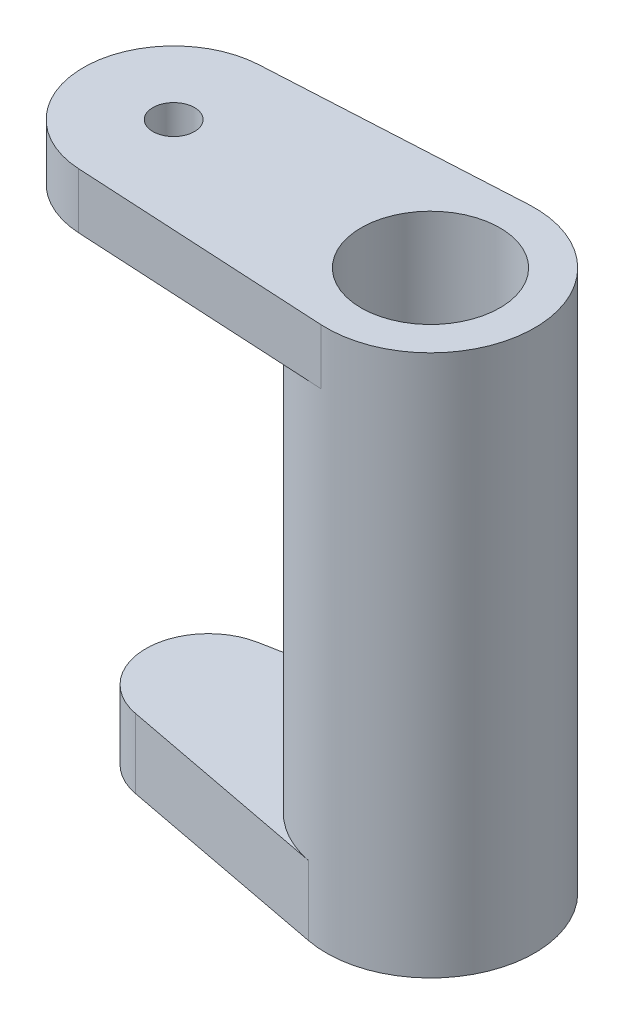
ISO-10303-21;
HEADER;
FILE_DESCRIPTION(('STEP AP214'),'2;1');
FILE_NAME('part.step','',(''),(''),'','','');
FILE_SCHEMA(('AUTOMOTIVE_DESIGN { 1 0 10303 214 1 1 1 1 }'));
ENDSEC;
DATA;
#1=APPLICATION_CONTEXT('core data for automotive mechanical design processes');
#2=APPLICATION_PROTOCOL_DEFINITION('international standard','automotive_design',2000,#1);
#3=PRODUCT_CONTEXT('',#1,'mechanical');
#4=PRODUCT('Part','Part','',(#3));
#5=PRODUCT_RELATED_PRODUCT_CATEGORY('part','',(#4));
#6=PRODUCT_DEFINITION_FORMATION('','',#4);
#7=PRODUCT_DEFINITION_CONTEXT('part definition',#1,'design');
#8=PRODUCT_DEFINITION('design','',#6,#7);
#9=PRODUCT_DEFINITION_SHAPE('','',#8);
#10=(LENGTH_UNIT() NAMED_UNIT(*) SI_UNIT(.MILLI.,.METRE.));
#11=(NAMED_UNIT(*) PLANE_ANGLE_UNIT() SI_UNIT($,.RADIAN.));
#12=(NAMED_UNIT(*) SI_UNIT($,.STERADIAN.) SOLID_ANGLE_UNIT());
#13=UNCERTAINTY_MEASURE_WITH_UNIT(LENGTH_MEASURE(1.E-05),#10,'distance_accuracy_value','');
#14=(GEOMETRIC_REPRESENTATION_CONTEXT(3) GLOBAL_UNCERTAINTY_ASSIGNED_CONTEXT((#13)) GLOBAL_UNIT_ASSIGNED_CONTEXT((#10,
#11,#12)) REPRESENTATION_CONTEXT('',''));
#15=CARTESIAN_POINT('',(0.,0.,0.));
#16=DIRECTION('',(0.,0.,1.));
#17=DIRECTION('',(1.,0.,0.));
#18=AXIS2_PLACEMENT_3D('',#15,#16,#17);
#19=CARTESIAN_POINT('',(-15.1843019154314,30.,1.03253253024933));
#20=DIRECTION('',(0.,-1.,0.));
#21=DIRECTION('',(0.,0.,-1.));
#22=AXIS2_PLACEMENT_3D('',#19,#20,#21);
#23=CYLINDRICAL_SURFACE('',#22,7.5);
#24=CARTESIAN_POINT('',(-15.1843019154314,30.,1.03253253024933));
#25=DIRECTION('',(0.,1.,0.));
#26=DIRECTION('',(0.,0.,1.));
#27=AXIS2_PLACEMENT_3D('',#24,#25,#26);
#28=CIRCLE('',#27,7.5);
#29=CARTESIAN_POINT('',(-15.5897073208368,30.,-6.45650255160654));
#30=VERTEX_POINT('',#29);
#31=CARTESIAN_POINT('',(-15.5897073208368,30.,8.52156761210521));
#32=VERTEX_POINT('',#31);
#33=EDGE_CURVE('E11',#30,#32,#28,.T.);
#34=ORIENTED_EDGE('',*,*,#33,.F.);
#35=DIRECTION('',(0.,-1.,0.));
#36=VECTOR('',#35,1.);
#37=CARTESIAN_POINT('',(-15.5897073208368,34.,-6.45650255160654));
#38=LINE('',#37,#36);
#39=CARTESIAN_POINT('',(-15.5897073208368,34.,-6.45650255160654));
#40=VERTEX_POINT('',#39);
#41=EDGE_CURVE('E148',#40,#30,#38,.T.);
#42=ORIENTED_EDGE('',*,*,#41,.F.);
#43=CARTESIAN_POINT('',(-15.1843019154314,34.,1.03253253024933));
#44=DIRECTION('',(0.,1.,0.));
#45=DIRECTION('',(0.,0.,1.));
#46=AXIS2_PLACEMENT_3D('',#43,#44,#45);
#47=CIRCLE('',#46,7.5);
#48=CARTESIAN_POINT('',(-15.5897073208368,34.,8.52156761210521));
#49=VERTEX_POINT('',#48);
#50=EDGE_CURVE('E131',#49,#40,#47,.T.);
#51=ORIENTED_EDGE('',*,*,#50,.F.);
#52=DIRECTION('',(0.,-1.,0.));
#53=VECTOR('',#52,1.);
#54=CARTESIAN_POINT('',(-15.5897073208368,34.,8.52156761210521));
#55=LINE('',#54,#53);
#56=EDGE_CURVE('E141',#49,#32,#55,.T.);
#57=ORIENTED_EDGE('',*,*,#56,.T.);
#58=EDGE_LOOP('',(#34,#42,#51,#57));
#59=FACE_BOUND('',#58,.T.);
#60=CARTESIAN_POINT('',(-15.1843019154314,0.,1.03253253024933));
#61=DIRECTION('',(0.,1.,0.));
#62=DIRECTION('',(0.,0.,1.));
#63=AXIS2_PLACEMENT_3D('',#60,#61,#62);
#64=CIRCLE('',#63,7.5);
#65=CARTESIAN_POINT('',(-16.5905519154314,0.,-6.33445199107959));
#66=VERTEX_POINT('',#65);
#67=CARTESIAN_POINT('',(-16.5905519154314,0.,8.39951705157826));
#68=VERTEX_POINT('',#67);
#69=EDGE_CURVE('E41',#66,#68,#64,.T.);
#70=ORIENTED_EDGE('',*,*,#69,.T.);
#71=DIRECTION('',(0.,1.,0.));
#72=VECTOR('',#71,1.);
#73=CARTESIAN_POINT('',(-16.5905519154314,-5.,8.39951705157826));
#74=LINE('',#73,#72);
#75=CARTESIAN_POINT('',(-16.5905519154314,-5.,8.39951705157826));
#76=VERTEX_POINT('',#75);
#77=EDGE_CURVE('E125',#76,#68,#74,.T.);
#78=ORIENTED_EDGE('',*,*,#77,.F.);
#79=CARTESIAN_POINT('',(-15.1843019154314,-5.,1.03253253024933));
#80=DIRECTION('',(0.,-1.,0.));
#81=DIRECTION('',(0.,0.,-1.));
#82=AXIS2_PLACEMENT_3D('',#79,#80,#81);
#83=CIRCLE('',#82,7.5);
#84=CARTESIAN_POINT('',(-16.5905519154314,-5.,-6.33445199107959));
#85=VERTEX_POINT('',#84);
#86=EDGE_CURVE('E106',#85,#76,#83,.T.);
#87=ORIENTED_EDGE('',*,*,#86,.F.);
#88=DIRECTION('',(0.,1.,0.));
#89=VECTOR('',#88,1.);
#90=CARTESIAN_POINT('',(-16.5905519154314,-5.,-6.33445199107959));
#91=LINE('',#90,#89);
#92=EDGE_CURVE('E49',#85,#66,#91,.T.);
#93=ORIENTED_EDGE('',*,*,#92,.T.);
#94=EDGE_LOOP('',(#70,#78,#87,#93));
#95=FACE_BOUND('',#94,.T.);
#96=ADVANCED_FACE('F33',(#59,#95),#23,.T.);
#97=CARTESIAN_POINT('',(-15.1843019154314,30.,1.03253253024933));
#98=DIRECTION('',(0.,1.,0.));
#99=DIRECTION('',(0.,0.,1.));
#100=AXIS2_PLACEMENT_3D('',#97,#98,#99);
#101=PLANE('',#100);
#102=CARTESIAN_POINT('',(-33.6843019154314,30.,1.03253253024933));
#103=DIRECTION('',(0.,1.,0.));
#104=DIRECTION('',(0.,0.,1.));
#105=AXIS2_PLACEMENT_3D('',#102,#103,#104);
#106=CIRCLE('',#105,1.5);
#107=CARTESIAN_POINT('',(-33.6843019154314,30.,2.53253253024934));
#108=VERTEX_POINT('',#107);
#109=EDGE_CURVE('E185',#108,#108,#106,.T.);
#110=ORIENTED_EDGE('',*,*,#109,.T.);
#111=EDGE_LOOP('',(#110));
#112=FACE_BOUND('',#111,.T.);
#113=DIRECTION('',(-0.998538010914117,0.,0.054054054054054));
#114=VECTOR('',#113,1.);
#115=CARTESIAN_POINT('',(-15.5897073208368,30.,-6.45650255160654));
#116=LINE('',#115,#114);
#117=CARTESIAN_POINT('',(-34.0356532667827,30.,-5.45796454069243));
#118=VERTEX_POINT('',#117);
#119=EDGE_CURVE('E121',#30,#118,#116,.T.);
#120=ORIENTED_EDGE('',*,*,#119,.F.);
#121=ORIENTED_EDGE('',*,*,#33,.T.);
#122=DIRECTION('',(0.998538010914117,0.,0.054054054054054));
#123=VECTOR('',#122,1.);
#124=CARTESIAN_POINT('',(-15.5897073208368,30.,8.52156761210521));
#125=LINE('',#124,#123);
#126=CARTESIAN_POINT('',(-34.0356532667827,30.,7.52302960119109));
#127=VERTEX_POINT('',#126);
#128=EDGE_CURVE('E135',#127,#32,#125,.T.);
#129=ORIENTED_EDGE('',*,*,#128,.F.);
#130=CARTESIAN_POINT('',(-33.6843019154314,30.,1.03253253024933));
#131=DIRECTION('',(0.,1.,0.));
#132=DIRECTION('',(0.,0.,1.));
#133=AXIS2_PLACEMENT_3D('',#130,#131,#132);
#134=CIRCLE('',#133,6.5);
#135=EDGE_CURVE('E123',#118,#127,#134,.T.);
#136=ORIENTED_EDGE('',*,*,#135,.F.);
#137=EDGE_LOOP('',(#120,#121,#129,#136));
#138=FACE_BOUND('',#137,.T.);
#139=ADVANCED_FACE('F214',(#112,#138),#101,.F.);
#140=CARTESIAN_POINT('',(-15.5897073208368,34.,-6.45650255160654));
#141=DIRECTION('',(0.054054054054054,0.,0.998538010914117));
#142=DIRECTION('',(0.998538010914117,0.,-0.054054054054054));
#143=AXIS2_PLACEMENT_3D('',#140,#141,#142);
#144=PLANE('',#143);
#145=ORIENTED_EDGE('',*,*,#119,.T.);
#146=DIRECTION('',(0.,-1.,0.));
#147=VECTOR('',#146,1.);
#148=CARTESIAN_POINT('',(-34.0356532667827,34.,-5.45796454069243));
#149=LINE('',#148,#147);
#150=CARTESIAN_POINT('',(-34.0356532667827,34.,-5.45796454069243));
#151=VERTEX_POINT('',#150);
#152=EDGE_CURVE('E146',#151,#118,#149,.T.);
#153=ORIENTED_EDGE('',*,*,#152,.F.);
#154=DIRECTION('',(-0.998538010914117,0.,0.054054054054054));
#155=VECTOR('',#154,1.);
#156=CARTESIAN_POINT('',(-15.5897073208368,34.,-6.45650255160654));
#157=LINE('',#156,#155);
#158=EDGE_CURVE('E134',#40,#151,#157,.T.);
#159=ORIENTED_EDGE('',*,*,#158,.F.);
#160=ORIENTED_EDGE('',*,*,#41,.T.);
#161=EDGE_LOOP('',(#145,#153,#159,#160));
#162=FACE_BOUND('',#161,.T.);
#163=ADVANCED_FACE('F219',(#162),#144,.F.);
#164=CARTESIAN_POINT('',(-33.6843019154314,34.,1.03253253024933));
#165=DIRECTION('',(0.,-1.,0.));
#166=DIRECTION('',(0.,0.,-1.));
#167=AXIS2_PLACEMENT_3D('',#164,#165,#166);
#168=CYLINDRICAL_SURFACE('',#167,6.5);
#169=ORIENTED_EDGE('',*,*,#135,.T.);
#170=DIRECTION('',(0.,-1.,0.));
#171=VECTOR('',#170,1.);
#172=CARTESIAN_POINT('',(-34.0356532667827,34.,7.52302960119109));
#173=LINE('',#172,#171);
#174=CARTESIAN_POINT('',(-34.0356532667827,34.,7.52302960119109));
#175=VERTEX_POINT('',#174);
#176=EDGE_CURVE('E143',#175,#127,#173,.T.);
#177=ORIENTED_EDGE('',*,*,#176,.F.);
#178=CARTESIAN_POINT('',(-33.6843019154314,34.,1.03253253024933));
#179=DIRECTION('',(0.,1.,0.));
#180=DIRECTION('',(0.,0.,1.));
#181=AXIS2_PLACEMENT_3D('',#178,#179,#180);
#182=CIRCLE('',#181,6.5);
#183=EDGE_CURVE('E137',#151,#175,#182,.T.);
#184=ORIENTED_EDGE('',*,*,#183,.F.);
#185=ORIENTED_EDGE('',*,*,#152,.T.);
#186=EDGE_LOOP('',(#169,#177,#184,#185));
#187=FACE_BOUND('',#186,.T.);
#188=ADVANCED_FACE('F236',(#187),#168,.T.);
#189=CARTESIAN_POINT('',(-15.5897073208368,34.,8.52156761210521));
#190=DIRECTION('',(0.054054054054054,0.,-0.998538010914117));
#191=DIRECTION('',(-0.998538010914117,0.,-0.054054054054054));
#192=AXIS2_PLACEMENT_3D('',#189,#190,#191);
#193=PLANE('',#192);
#194=ORIENTED_EDGE('',*,*,#128,.T.);
#195=ORIENTED_EDGE('',*,*,#56,.F.);
#196=DIRECTION('',(0.998538010914117,0.,0.054054054054054));
#197=VECTOR('',#196,1.);
#198=CARTESIAN_POINT('',(-15.5897073208368,34.,8.52156761210521));
#199=LINE('',#198,#197);
#200=EDGE_CURVE('E139',#175,#49,#199,.T.);
#201=ORIENTED_EDGE('',*,*,#200,.F.);
#202=ORIENTED_EDGE('',*,*,#176,.T.);
#203=EDGE_LOOP('',(#194,#195,#201,#202));
#204=FACE_BOUND('',#203,.T.);
#205=ADVANCED_FACE('F234',(#204),#193,.F.);
#206=CARTESIAN_POINT('',(-15.1843019154314,34.,1.03253253024933));
#207=DIRECTION('',(0.,1.,0.));
#208=DIRECTION('',(0.,0.,1.));
#209=AXIS2_PLACEMENT_3D('',#206,#207,#208);
#210=PLANE('',#209);
#211=CARTESIAN_POINT('',(-15.1843019154314,34.,1.03253253024933));
#212=DIRECTION('',(0.,1.,0.));
#213=DIRECTION('',(0.,0.,1.));
#214=AXIS2_PLACEMENT_3D('',#211,#212,#213);
#215=CIRCLE('',#214,5.);
#216=CARTESIAN_POINT('',(-15.1843019154314,34.,6.03253253024933));
#217=VERTEX_POINT('',#216);
#218=EDGE_CURVE('E194',#217,#217,#215,.T.);
#219=ORIENTED_EDGE('',*,*,#218,.F.);
#220=EDGE_LOOP('',(#219));
#221=FACE_BOUND('',#220,.T.);
#222=CARTESIAN_POINT('',(-33.6843019154314,34.,1.03253253024933));
#223=DIRECTION('',(0.,1.,0.));
#224=DIRECTION('',(0.,0.,1.));
#225=AXIS2_PLACEMENT_3D('',#222,#223,#224);
#226=CIRCLE('',#225,1.5);
#227=CARTESIAN_POINT('',(-33.6843019154314,34.,2.53253253024934));
#228=VERTEX_POINT('',#227);
#229=EDGE_CURVE('E187',#228,#228,#226,.T.);
#230=ORIENTED_EDGE('',*,*,#229,.F.);
#231=EDGE_LOOP('',(#230));
#232=FACE_BOUND('',#231,.T.);
#233=ORIENTED_EDGE('',*,*,#50,.T.);
#234=ORIENTED_EDGE('',*,*,#158,.T.);
#235=ORIENTED_EDGE('',*,*,#183,.T.);
#236=ORIENTED_EDGE('',*,*,#200,.T.);
#237=EDGE_LOOP('',(#233,#234,#235,#236));
#238=FACE_BOUND('',#237,.T.);
#239=ADVANCED_FACE('F230',(#221,#232,#238),#210,.T.);
#240=CARTESIAN_POINT('',(-31.1843019154313,-5.,1.03253253024933));
#241=DIRECTION('',(0.,1.,0.));
#242=DIRECTION('',(0.,0.,1.));
#243=AXIS2_PLACEMENT_3D('',#240,#241,#242);
#244=CYLINDRICAL_SURFACE('',#243,4.5);
#245=CARTESIAN_POINT('',(-31.1843019154313,0.,1.03253253024933));
#246=DIRECTION('',(0.,-1.,0.));
#247=DIRECTION('',(0.,0.,-1.));
#248=AXIS2_PLACEMENT_3D('',#245,#246,#247);
#249=CIRCLE('',#248,4.5);
#250=CARTESIAN_POINT('',(-32.0280519154313,0.,5.45272324304669));
#251=VERTEX_POINT('',#250);
#252=CARTESIAN_POINT('',(-32.0280519154313,0.,-3.38765818254803));
#253=VERTEX_POINT('',#252);
#254=EDGE_CURVE('E120',#251,#253,#249,.T.);
#255=ORIENTED_EDGE('',*,*,#254,.T.);
#256=DIRECTION('',(0.,1.,0.));
#257=VECTOR('',#256,1.);
#258=CARTESIAN_POINT('',(-32.0280519154313,-5.,-3.38765818254803));
#259=LINE('',#258,#257);
#260=CARTESIAN_POINT('',(-32.0280519154313,-5.,-3.38765818254803));
#261=VERTEX_POINT('',#260);
#262=EDGE_CURVE('E103',#261,#253,#259,.T.);
#263=ORIENTED_EDGE('',*,*,#262,.F.);
#264=CARTESIAN_POINT('',(-31.1843019154313,-5.,1.03253253024933));
#265=DIRECTION('',(0.,-1.,0.));
#266=DIRECTION('',(0.,0.,-1.));
#267=AXIS2_PLACEMENT_3D('',#264,#265,#266);
#268=CIRCLE('',#267,4.5);
#269=CARTESIAN_POINT('',(-32.0280519154313,-5.,5.45272324304669));
#270=VERTEX_POINT('',#269);
#271=EDGE_CURVE('E107',#270,#261,#268,.T.);
#272=ORIENTED_EDGE('',*,*,#271,.F.);
#273=DIRECTION('',(0.,1.,0.));
#274=VECTOR('',#273,1.);
#275=CARTESIAN_POINT('',(-32.0280519154313,-5.,5.45272324304669));
#276=LINE('',#275,#274);
#277=EDGE_CURVE('E129',#270,#251,#276,.T.);
#278=ORIENTED_EDGE('',*,*,#277,.T.);
#279=EDGE_LOOP('',(#255,#263,#272,#278));
#280=FACE_BOUND('',#279,.T.);
#281=ADVANCED_FACE('F118',(#280),#244,.T.);
#282=CARTESIAN_POINT('',(-32.0280519154313,-5.,-3.38765818254803));
#283=DIRECTION('',(0.1875,0.,0.982264602843857));
#284=DIRECTION('',(0.982264602843857,0.,-0.1875));
#285=AXIS2_PLACEMENT_3D('',#282,#283,#284);
#286=PLANE('',#285);
#287=DIRECTION('',(0.982264602843857,0.,-0.1875));
#288=VECTOR('',#287,1.);
#289=CARTESIAN_POINT('',(-32.0280519154313,0.,-3.38765818254803));
#290=LINE('',#289,#288);
#291=EDGE_CURVE('E170',#253,#66,#290,.T.);
#292=ORIENTED_EDGE('',*,*,#291,.T.);
#293=ORIENTED_EDGE('',*,*,#92,.F.);
#294=DIRECTION('',(0.982264602843857,0.,-0.1875));
#295=VECTOR('',#294,1.);
#296=CARTESIAN_POINT('',(-32.0280519154313,-5.,-3.38765818254803));
#297=LINE('',#296,#295);
#298=EDGE_CURVE('E99',#261,#85,#297,.T.);
#299=ORIENTED_EDGE('',*,*,#298,.F.);
#300=ORIENTED_EDGE('',*,*,#262,.T.);
#301=EDGE_LOOP('',(#292,#293,#299,#300));
#302=FACE_BOUND('',#301,.T.);
#303=ADVANCED_FACE('F101',(#302),#286,.F.);
#304=CARTESIAN_POINT('',(-32.0280519154313,-5.,5.45272324304669));
#305=DIRECTION('',(0.1875,0.,-0.982264602843857));
#306=DIRECTION('',(-0.982264602843857,0.,-0.1875));
#307=AXIS2_PLACEMENT_3D('',#304,#305,#306);
#308=PLANE('',#307);
#309=DIRECTION('',(-0.982264602843857,0.,-0.1875));
#310=VECTOR('',#309,1.);
#311=CARTESIAN_POINT('',(-32.0280519154313,0.,5.45272324304669));
#312=LINE('',#311,#310);
#313=EDGE_CURVE('E116',#68,#251,#312,.T.);
#314=ORIENTED_EDGE('',*,*,#313,.T.);
#315=ORIENTED_EDGE('',*,*,#277,.F.);
#316=DIRECTION('',(-0.982264602843857,0.,-0.1875));
#317=VECTOR('',#316,1.);
#318=CARTESIAN_POINT('',(-32.0280519154313,-5.,5.45272324304669));
#319=LINE('',#318,#317);
#320=EDGE_CURVE('E112',#76,#270,#319,.T.);
#321=ORIENTED_EDGE('',*,*,#320,.F.);
#322=ORIENTED_EDGE('',*,*,#77,.T.);
#323=EDGE_LOOP('',(#314,#315,#321,#322));
#324=FACE_BOUND('',#323,.T.);
#325=ADVANCED_FACE('F180',(#324),#308,.F.);
#326=CARTESIAN_POINT('',(-31.1843019154313,-5.,1.03253253024933));
#327=DIRECTION('',(0.,-1.,0.));
#328=DIRECTION('',(0.,0.,-1.));
#329=AXIS2_PLACEMENT_3D('',#326,#327,#328);
#330=PLANE('',#329);
#331=CARTESIAN_POINT('',(-15.1843019154314,-5.,1.03253253024933));
#332=DIRECTION('',(0.,-1.,0.));
#333=DIRECTION('',(0.,0.,-1.));
#334=AXIS2_PLACEMENT_3D('',#331,#332,#333);
#335=CIRCLE('',#334,5.);
#336=CARTESIAN_POINT('',(-15.1843019154314,-5.,-3.96746746975067));
#337=VERTEX_POINT('',#336);
#338=EDGE_CURVE('E36',#337,#337,#335,.T.);
#339=ORIENTED_EDGE('',*,*,#338,.F.);
#340=EDGE_LOOP('',(#339));
#341=FACE_BOUND('',#340,.T.);
#342=ORIENTED_EDGE('',*,*,#271,.T.);
#343=ORIENTED_EDGE('',*,*,#298,.T.);
#344=ORIENTED_EDGE('',*,*,#86,.T.);
#345=ORIENTED_EDGE('',*,*,#320,.T.);
#346=EDGE_LOOP('',(#342,#343,#344,#345));
#347=FACE_BOUND('',#346,.T.);
#348=ADVANCED_FACE('F110',(#341,#347),#330,.T.);
#349=CARTESIAN_POINT('',(-31.1843019154313,0.,1.03253253024933));
#350=DIRECTION('',(0.,-1.,0.));
#351=DIRECTION('',(0.,0.,-1.));
#352=AXIS2_PLACEMENT_3D('',#349,#350,#351);
#353=PLANE('',#352);
#354=ORIENTED_EDGE('',*,*,#69,.F.);
#355=ORIENTED_EDGE('',*,*,#291,.F.);
#356=ORIENTED_EDGE('',*,*,#254,.F.);
#357=ORIENTED_EDGE('',*,*,#313,.F.);
#358=EDGE_LOOP('',(#354,#355,#356,#357));
#359=FACE_BOUND('',#358,.T.);
#360=ADVANCED_FACE('F184',(#359),#353,.F.);
#361=CARTESIAN_POINT('',(-33.6843019154314,29.,1.03253253024933));
#362=DIRECTION('',(0.,1.,0.));
#363=DIRECTION('',(0.,0.,1.));
#364=AXIS2_PLACEMENT_3D('',#361,#362,#363);
#365=CYLINDRICAL_SURFACE('',#364,1.5);
#366=ORIENTED_EDGE('',*,*,#229,.T.);
#367=EDGE_LOOP('',(#366));
#368=FACE_BOUND('',#367,.T.);
#369=ORIENTED_EDGE('',*,*,#109,.F.);
#370=EDGE_LOOP('',(#369));
#371=FACE_BOUND('',#370,.T.);
#372=ADVANCED_FACE('F209',(#368,#371),#365,.F.);
#373=CARTESIAN_POINT('',(-15.1843019154314,-5.000025,1.03253253024933));
#374=DIRECTION('',(0.,1.,0.));
#375=DIRECTION('',(0.,0.,1.));
#376=AXIS2_PLACEMENT_3D('',#373,#374,#375);
#377=CYLINDRICAL_SURFACE('',#376,5.);
#378=ORIENTED_EDGE('',*,*,#338,.T.);
#379=EDGE_LOOP('',(#378));
#380=FACE_BOUND('',#379,.T.);
#381=ORIENTED_EDGE('',*,*,#218,.T.);
#382=EDGE_LOOP('',(#381));
#383=FACE_BOUND('',#382,.T.);
#384=ADVANCED_FACE('F201',(#380,#383),#377,.F.);
#385=CLOSED_SHELL('',(#96,#139,#163,#188,#205,#239,#281,#303,#325,#348,#360,#372,#384));
#386=MANIFOLD_SOLID_BREP('B2',#385);
#387=ADVANCED_BREP_SHAPE_REPRESENTATION('',(#18,#386),#14);
#388=SHAPE_DEFINITION_REPRESENTATION(#9,#387);
ENDSEC;
END-ISO-10303-21;
